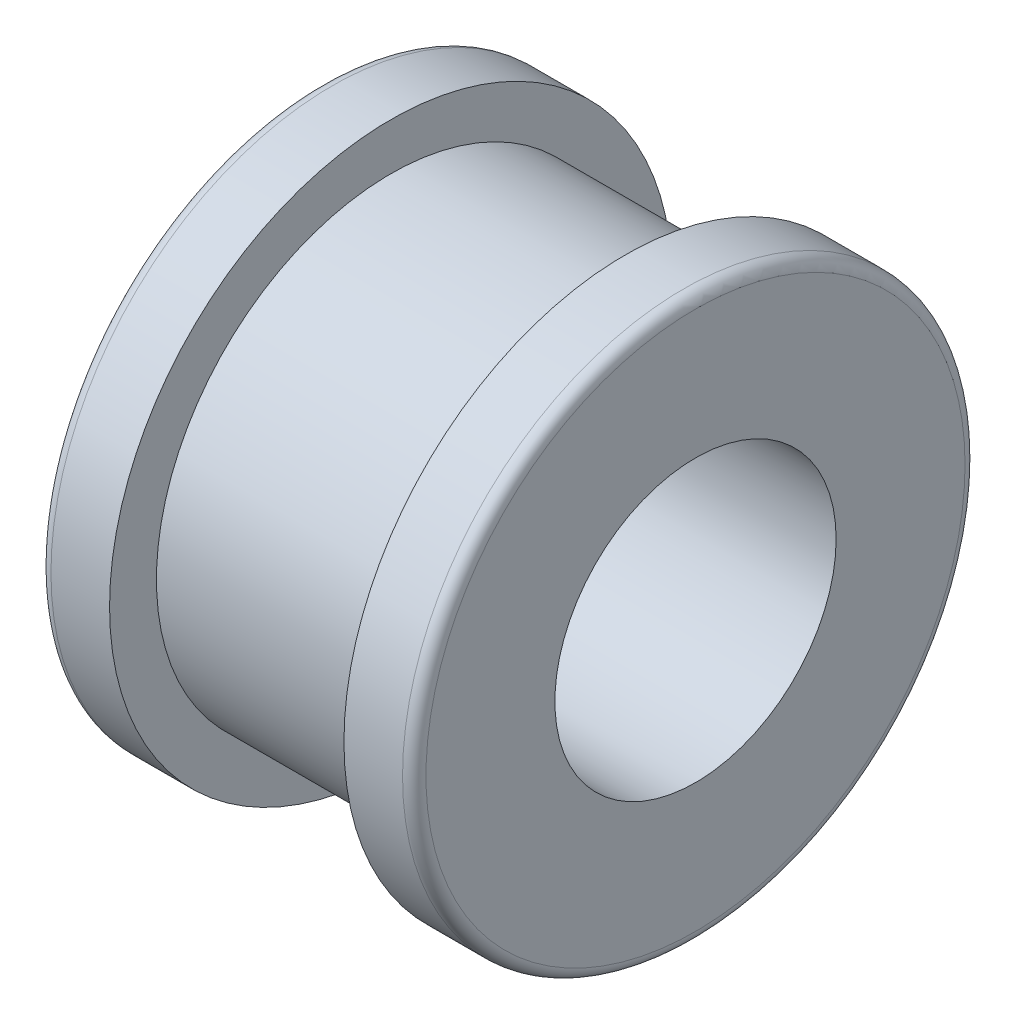
ISO-10303-21;
HEADER;
FILE_DESCRIPTION(('STEP AP214'),'2;1');
FILE_NAME('part.step','',(''),(''),'','','');
FILE_SCHEMA(('AUTOMOTIVE_DESIGN { 1 0 10303 214 1 1 1 1 }'));
ENDSEC;
DATA;
#1=APPLICATION_CONTEXT('core data for automotive mechanical design processes');
#2=APPLICATION_PROTOCOL_DEFINITION('international standard','automotive_design',2000,#1);
#3=PRODUCT_CONTEXT('',#1,'mechanical');
#4=PRODUCT('Part','Part','',(#3));
#5=PRODUCT_RELATED_PRODUCT_CATEGORY('part','',(#4));
#6=PRODUCT_DEFINITION_FORMATION('','',#4);
#7=PRODUCT_DEFINITION_CONTEXT('part definition',#1,'design');
#8=PRODUCT_DEFINITION('design','',#6,#7);
#9=PRODUCT_DEFINITION_SHAPE('','',#8);
#10=(LENGTH_UNIT() NAMED_UNIT(*) SI_UNIT(.MILLI.,.METRE.));
#11=(NAMED_UNIT(*) PLANE_ANGLE_UNIT() SI_UNIT($,.RADIAN.));
#12=(NAMED_UNIT(*) SI_UNIT($,.STERADIAN.) SOLID_ANGLE_UNIT());
#13=UNCERTAINTY_MEASURE_WITH_UNIT(LENGTH_MEASURE(1.E-05),#10,'distance_accuracy_value','');
#14=(GEOMETRIC_REPRESENTATION_CONTEXT(3) GLOBAL_UNCERTAINTY_ASSIGNED_CONTEXT((#13)) GLOBAL_UNIT_ASSIGNED_CONTEXT((#10,
#11,#12)) REPRESENTATION_CONTEXT('',''));
#15=CARTESIAN_POINT('',(0.,0.,0.));
#16=DIRECTION('',(0.,0.,1.));
#17=DIRECTION('',(1.,0.,0.));
#18=AXIS2_PLACEMENT_3D('',#15,#16,#17);
#19=CARTESIAN_POINT('',(8.,0.,0.));
#20=DIRECTION('',(-1.,0.,0.));
#21=DIRECTION('',(0.,0.,1.));
#22=AXIS2_PLACEMENT_3D('',#19,#20,#21);
#23=CYLINDRICAL_SURFACE('',#22,12.);
#24=CARTESIAN_POINT('',(-7.5,0.,0.));
#25=DIRECTION('',(1.,0.,0.));
#26=DIRECTION('',(0.,0.,-1.));
#27=AXIS2_PLACEMENT_3D('',#24,#25,#26);
#28=CIRCLE('',#27,12.);
#29=CARTESIAN_POINT('',(-7.5,0.,-12.));
#30=VERTEX_POINT('',#29);
#31=EDGE_CURVE('E51',#30,#30,#28,.T.);
#32=ORIENTED_EDGE('',*,*,#31,.T.);
#33=EDGE_LOOP('',(#32));
#34=FACE_BOUND('',#33,.T.);
#35=CARTESIAN_POINT('',(-5.,0.,0.));
#36=DIRECTION('',(1.,0.,0.));
#37=DIRECTION('',(0.,0.,-1.));
#38=AXIS2_PLACEMENT_3D('',#35,#36,#37);
#39=CIRCLE('',#38,12.);
#40=CARTESIAN_POINT('',(-5.,0.,-12.));
#41=VERTEX_POINT('',#40);
#42=EDGE_CURVE('E63',#41,#41,#39,.T.);
#43=ORIENTED_EDGE('',*,*,#42,.F.);
#44=EDGE_LOOP('',(#43));
#45=FACE_BOUND('',#44,.T.);
#46=ADVANCED_FACE('F38',(#34,#45),#23,.T.);
#47=CARTESIAN_POINT('',(-8.,0.,0.));
#48=DIRECTION('',(1.,0.,0.));
#49=DIRECTION('',(0.,0.,-1.));
#50=AXIS2_PLACEMENT_3D('',#47,#48,#49);
#51=PLANE('',#50);
#52=CARTESIAN_POINT('',(-8.,0.,0.));
#53=DIRECTION('',(1.,0.,0.));
#54=DIRECTION('',(0.,0.,-1.));
#55=AXIS2_PLACEMENT_3D('',#52,#53,#54);
#56=CIRCLE('',#55,11.5);
#57=CARTESIAN_POINT('',(-8.,0.,-11.5));
#58=VERTEX_POINT('',#57);
#59=EDGE_CURVE('E10',#58,#58,#56,.F.);
#60=ORIENTED_EDGE('',*,*,#59,.T.);
#61=EDGE_LOOP('',(#60));
#62=FACE_BOUND('',#61,.T.);
#63=CARTESIAN_POINT('',(-8.,0.,0.));
#64=DIRECTION('',(1.,0.,0.));
#65=DIRECTION('',(0.,0.,-1.));
#66=AXIS2_PLACEMENT_3D('',#63,#64,#65);
#67=CIRCLE('',#66,6.);
#68=CARTESIAN_POINT('',(-8.,0.,-6.));
#69=VERTEX_POINT('',#68);
#70=EDGE_CURVE('E73',#69,#69,#67,.T.);
#71=ORIENTED_EDGE('',*,*,#70,.T.);
#72=EDGE_LOOP('',(#71));
#73=FACE_BOUND('',#72,.T.);
#74=ADVANCED_FACE('F112',(#62,#73),#51,.F.);
#75=CARTESIAN_POINT('',(-5.,0.,0.));
#76=DIRECTION('',(1.,0.,0.));
#77=DIRECTION('',(0.,0.,-1.));
#78=AXIS2_PLACEMENT_3D('',#75,#76,#77);
#79=PLANE('',#78);
#80=CARTESIAN_POINT('',(-5.,0.,0.));
#81=DIRECTION('',(1.,0.,0.));
#82=DIRECTION('',(0.,0.,-1.));
#83=AXIS2_PLACEMENT_3D('',#80,#81,#82);
#84=CIRCLE('',#83,10.);
#85=CARTESIAN_POINT('',(-5.,0.,-10.));
#86=VERTEX_POINT('',#85);
#87=EDGE_CURVE('E67',#86,#86,#84,.T.);
#88=ORIENTED_EDGE('',*,*,#87,.F.);
#89=EDGE_LOOP('',(#88));
#90=FACE_BOUND('',#89,.T.);
#91=ORIENTED_EDGE('',*,*,#42,.T.);
#92=EDGE_LOOP('',(#91));
#93=FACE_BOUND('',#92,.T.);
#94=ADVANCED_FACE('F117',(#90,#93),#79,.T.);
#95=CARTESIAN_POINT('',(5.,0.,0.));
#96=DIRECTION('',(1.,0.,0.));
#97=DIRECTION('',(0.,0.,-1.));
#98=AXIS2_PLACEMENT_3D('',#95,#96,#97);
#99=PLANE('',#98);
#100=CARTESIAN_POINT('',(5.,0.,0.));
#101=DIRECTION('',(1.,0.,0.));
#102=DIRECTION('',(0.,0.,-1.));
#103=AXIS2_PLACEMENT_3D('',#100,#101,#102);
#104=CIRCLE('',#103,10.);
#105=CARTESIAN_POINT('',(5.,0.,-10.));
#106=VERTEX_POINT('',#105);
#107=EDGE_CURVE('E70',#106,#106,#104,.T.);
#108=ORIENTED_EDGE('',*,*,#107,.T.);
#109=EDGE_LOOP('',(#108));
#110=FACE_BOUND('',#109,.T.);
#111=CARTESIAN_POINT('',(5.,0.,0.));
#112=DIRECTION('',(1.,0.,0.));
#113=DIRECTION('',(0.,0.,-1.));
#114=AXIS2_PLACEMENT_3D('',#111,#112,#113);
#115=CIRCLE('',#114,12.);
#116=CARTESIAN_POINT('',(5.,0.,-12.));
#117=VERTEX_POINT('',#116);
#118=EDGE_CURVE('E64',#117,#117,#115,.T.);
#119=ORIENTED_EDGE('',*,*,#118,.F.);
#120=EDGE_LOOP('',(#119));
#121=FACE_BOUND('',#120,.T.);
#122=ADVANCED_FACE('F124',(#110,#121),#99,.F.);
#123=CARTESIAN_POINT('',(-5.,0.,0.));
#124=DIRECTION('',(1.,0.,0.));
#125=DIRECTION('',(0.,0.,-1.));
#126=AXIS2_PLACEMENT_3D('',#123,#124,#125);
#127=CYLINDRICAL_SURFACE('',#126,10.);
#128=CARTESIAN_POINT('',(1.,-10.,0.));
#129=CARTESIAN_POINT('',(0.99999757409962,-9.99999935520769,0.0560203537915572));
#130=CARTESIAN_POINT('',(0.995276731103556,-9.99952425596206,0.112077745167773));
#131=CARTESIAN_POINT('',(0.976515629709573,-9.99767467594738,0.222638398496837));
#132=CARTESIAN_POINT('',(0.962465103975411,-9.99629920434026,0.277139879168828));
#133=CARTESIAN_POINT('',(0.925457759402168,-9.9928041456307,0.382971675453414));
#134=CARTESIAN_POINT('',(0.902506319481526,-9.99068500800708,0.434303884614909));
#135=CARTESIAN_POINT('',(0.848359092068356,-9.98593957394306,0.532376160960406));
#136=CARTESIAN_POINT('',(0.817164943999862,-9.98331337838132,0.579117138779076));
#137=CARTESIAN_POINT('',(0.747297302337726,-9.97783744341324,0.666859550674082));
#138=CARTESIAN_POINT('',(0.708600200597966,-9.97498701573866,0.707842144834892));
#139=CARTESIAN_POINT('',(0.62487546573697,-9.96938956906263,0.782742521430984));
#140=CARTESIAN_POINT('',(0.579847539957613,-9.96664255484917,0.816659977082653));
#141=CARTESIAN_POINT('',(0.484621468316379,-9.96155591552784,0.876533970443617));
#142=CARTESIAN_POINT('',(0.434412555905142,-9.95921716710905,0.902473465454879));
#143=CARTESIAN_POINT('',(0.330324414095021,-9.95522037546525,0.94554638474276));
#144=CARTESIAN_POINT('',(0.27644527541605,-9.95356231542222,0.962680026591291));
#145=CARTESIAN_POINT('',(0.166738199133991,-9.95112084072978,0.987599041601893));
#146=CARTESIAN_POINT('',(0.110917423147792,-9.95033450398097,0.995415653003795));
#147=CARTESIAN_POINT('',(-0.00124886339578044,-9.94971643060526,1.00157528513536));
#148=CARTESIAN_POINT('',(-0.0575943601220591,-9.94988466888746,0.999918554870802));
#149=CARTESIAN_POINT('',(-0.168995309693318,-9.95115406898935,0.987204280252678));
#150=CARTESIAN_POINT('',(-0.224054699328694,-9.95225184590651,0.976180844124552));
#151=CARTESIAN_POINT('',(-0.331537963201094,-9.95525134287419,0.945099144150586));
#152=CARTESIAN_POINT('',(-0.383961801825031,-9.95715307378492,0.925040758255746));
#153=CARTESIAN_POINT('',(-0.484793587298889,-9.9615500945207,0.876420893881507));
#154=CARTESIAN_POINT('',(-0.533194189489316,-9.96404643908158,0.84784428271998));
#155=CARTESIAN_POINT('',(-0.624525214911882,-9.96935051732879,0.783010027353227));
#156=CARTESIAN_POINT('',(-0.667455477981763,-9.97215826012785,0.746752158336505));
#157=CARTESIAN_POINT('',(-0.746825393989027,-9.9777838531299,0.667394112412069));
#158=CARTESIAN_POINT('',(-0.783235601880805,-9.98060169332997,0.624264478851363));
#159=CARTESIAN_POINT('',(-0.848303632910388,-9.98591829078518,0.532489481737112));
#160=CARTESIAN_POINT('',(-0.876961447356476,-9.98841704768256,0.483844111999601));
#161=CARTESIAN_POINT('',(-0.925710020310253,-9.99281475667096,0.382398105692365));
#162=CARTESIAN_POINT('',(-0.945799284818062,-9.9947136041477,0.329596746389903));
#163=CARTESIAN_POINT('',(-0.976818916711752,-9.99769647441409,0.221347217329932));
#164=CARTESIAN_POINT('',(-0.987749557990623,-9.99878052157063,0.1658991267766));
#165=CARTESIAN_POINT('',(-1.00010430773477,-10.0000085166831,0.0541850990919041));
#166=CARTESIAN_POINT('',(-1.0015690482525,-10.0001564826774,-0.00207630210549165));
#167=CARTESIAN_POINT('',(-0.995057136951236,-9.99950641756797,-0.114043793315699));
#168=CARTESIAN_POINT('',(-0.98708061268472,-9.99870839924468,-0.16974989082047));
#169=CARTESIAN_POINT('',(-0.961946304578424,-9.99625861539194,-0.278908206834674));
#170=CARTESIAN_POINT('',(-0.944807545521989,-9.99460861918039,-0.332364848972019));
#171=CARTESIAN_POINT('',(-0.901854825962729,-9.99063998860609,-0.435644321383781));
#172=CARTESIAN_POINT('',(-0.876040670960603,-9.98832133925254,-0.485467070157117));
#173=CARTESIAN_POINT('',(-0.816369161336087,-9.98326475330422,-0.580248180172142));
#174=CARTESIAN_POINT('',(-0.782485111074183,-9.98052543603441,-0.625189659748917));
#175=CARTESIAN_POINT('',(-0.707673932259073,-9.9749393286952,-0.708761623311878));
#176=CARTESIAN_POINT('',(-0.666746626929683,-9.97209253592971,-0.747391948849177));
#177=CARTESIAN_POINT('',(-0.578833425340999,-9.96660024140755,-0.817386109887145));
#178=CARTESIAN_POINT('',(-0.531826243457378,-9.96395550138975,-0.848723278679543));
#179=CARTESIAN_POINT('',(-0.433192639853315,-9.9591783246089,-0.903058258743828));
#180=CARTESIAN_POINT('',(-0.381566281311604,-9.95704588084038,-0.926056184053882));
#181=CARTESIAN_POINT('',(-0.275251260534206,-9.9535394763405,-0.963015208684475));
#182=CARTESIAN_POINT('',(-0.220568159908879,-9.95216418449789,-0.976992174811861));
#183=CARTESIAN_POINT('',(-0.109616802039228,-9.95032365282877,-0.995564007129462));
#184=CARTESIAN_POINT('',(-0.0533485903043259,-9.94985838690186,-1.00015914239952));
#185=CARTESIAN_POINT('',(0.0589106883567047,-9.94989113107562,-0.999833138471256));
#186=CARTESIAN_POINT('',(0.114901882882815,-9.95038490087009,-0.994953889593112));
#187=CARTESIAN_POINT('',(0.225264917168288,-9.95227103889546,-0.975905452963653));
#188=CARTESIAN_POINT('',(0.27963675510598,-9.95366340813719,-0.96173625476216));
#189=CARTESIAN_POINT('',(0.385217349047857,-9.95718868263187,-0.924521686297503));
#190=CARTESIAN_POINT('',(0.436426541629725,-9.95932148540361,-0.901477544340916));
#191=CARTESIAN_POINT('',(0.534256891671035,-9.96408751839359,-0.847171554911043));
#192=CARTESIAN_POINT('',(0.58087807482063,-9.96672074580951,-0.815909753455415));
#193=CARTESIAN_POINT('',(0.668423674471935,-9.97220487209698,-0.745898556285331));
#194=CARTESIAN_POINT('',(0.709323076367086,-9.97505664726751,-0.707117948890268));
#195=CARTESIAN_POINT('',(0.784052232699658,-9.98064854728783,-0.623231699225109));
#196=CARTESIAN_POINT('',(0.81788029135717,-9.98338864522976,-0.578124544108257));
#197=CARTESIAN_POINT('',(0.877573453854621,-9.98845562069162,-0.482741434161289));
#198=CARTESIAN_POINT('',(0.903418290945183,-9.99078144026812,-0.432452749346764));
#199=CARTESIAN_POINT('',(0.946262422823868,-9.99474629249896,-0.328258279100551));
#200=CARTESIAN_POINT('',(0.963271690953547,-9.99638609909654,-0.274356649825609));
#201=CARTESIAN_POINT('',(0.983720617084802,-9.99838213773734,-0.183458261405704));
#202=CARTESIAN_POINT('',(0.989817044299357,-9.99898600691833,-0.147042552844509));
#203=CARTESIAN_POINT('',(0.997957526061762,-9.99979514950786,-0.073756580817313));
#204=CARTESIAN_POINT('',(1.00000159732186,-10.0000004245602,-0.0368863192265578));
#205=CARTESIAN_POINT('',(1.,-10.,0.));
#206=B_SPLINE_CURVE_WITH_KNOTS('',3,(#128,#129,#130,#131,#132,#133,#134,#135,#136,#137,#138,
#139,#140,#141,#142,#143,#144,#145,#146,#147,#148,#149,#150,#151,#152,#153,#154,#155,#156,#157,
#158,#159,#160,#161,#162,#163,#164,#165,#166,#167,#168,#169,#170,#171,#172,#173,#174,#175,#176,
#177,#178,#179,#180,#181,#182,#183,#184,#185,#186,#187,#188,#189,#190,#191,#192,#193,#194,#195,
#196,#197,#198,#199,#200,#201,#202,#203,#204,#205),.UNSPECIFIED.,.T.,.F.,(4,2,2,2,2,2,2,2,2,2,2,
2,2,2,2,2,2,2,2,2,2,2,2,2,2,2,2,2,2,2,2,2,2,2,2,2,2,2,4),(0.,0.167926366268474,
0.336037842835486,0.504047885732202,0.672024537582782,0.840538568622945,1.00906039220706,
1.17793975472222,1.34681494442504,1.51512232045197,1.68342527255776,1.8511179744111,
2.01881294161634,2.18680761372895,2.35480720331125,2.52354734196207,2.69228766979772,
2.86105740693581,3.02982209675439,3.19786188607758,3.36589940519143,3.53358935294305,
3.70128306049467,3.86953940748698,4.0377999781023,4.20666643608598,4.37553058475374,
4.54409690593003,4.71265839239585,4.88047629293956,5.04829438226039,5.216089253628,
5.3838831853896,5.55238917427653,5.72093552636958,5.88990631026242,6.05868594795295,
6.16925667232348,6.27982694069027),.UNSPECIFIED.);
#207=CARTESIAN_POINT('',(1.,-10.,0.));
#208=VERTEX_POINT('',#207);
#209=EDGE_CURVE('E81',#208,#208,#206,.T.);
#210=ORIENTED_EDGE('',*,*,#209,.F.);
#211=EDGE_LOOP('',(#210));
#212=FACE_BOUND('',#211,.T.);
#213=ORIENTED_EDGE('',*,*,#87,.T.);
#214=EDGE_LOOP('',(#213));
#215=FACE_BOUND('',#214,.T.);
#216=ORIENTED_EDGE('',*,*,#107,.F.);
#217=EDGE_LOOP('',(#216));
#218=FACE_BOUND('',#217,.T.);
#219=ADVANCED_FACE('F87',(#212,#215,#218),#127,.T.);
#220=CARTESIAN_POINT('',(8.,0.,0.));
#221=DIRECTION('',(1.,0.,0.));
#222=DIRECTION('',(0.,0.,-1.));
#223=AXIS2_PLACEMENT_3D('',#220,#221,#222);
#224=PLANE('',#223);
#225=CARTESIAN_POINT('',(8.,0.,0.));
#226=DIRECTION('',(1.,0.,0.));
#227=DIRECTION('',(0.,0.,-1.));
#228=AXIS2_PLACEMENT_3D('',#225,#226,#227);
#229=CIRCLE('',#228,11.5);
#230=CARTESIAN_POINT('',(8.,0.,-11.5));
#231=VERTEX_POINT('',#230);
#232=EDGE_CURVE('E60',#231,#231,#229,.T.);
#233=ORIENTED_EDGE('',*,*,#232,.T.);
#234=EDGE_LOOP('',(#233));
#235=FACE_BOUND('',#234,.T.);
#236=CARTESIAN_POINT('',(8.,0.,0.));
#237=DIRECTION('',(1.,0.,0.));
#238=DIRECTION('',(0.,0.,-1.));
#239=AXIS2_PLACEMENT_3D('',#236,#237,#238);
#240=CIRCLE('',#239,6.);
#241=CARTESIAN_POINT('',(8.,0.,-6.));
#242=VERTEX_POINT('',#241);
#243=EDGE_CURVE('E78',#242,#242,#240,.T.);
#244=ORIENTED_EDGE('',*,*,#243,.F.);
#245=EDGE_LOOP('',(#244));
#246=FACE_BOUND('',#245,.T.);
#247=ADVANCED_FACE('F106',(#235,#246),#224,.T.);
#248=CARTESIAN_POINT('',(7.5,0.,0.));
#249=DIRECTION('',(1.,0.,0.));
#250=DIRECTION('',(0.,0.,-1.));
#251=AXIS2_PLACEMENT_3D('',#248,#249,#250);
#252=CIRCLE('',#251,12.);
#253=CARTESIAN_POINT('',(7.5,0.,-12.));
#254=VERTEX_POINT('',#253);
#255=EDGE_CURVE('E55',#254,#254,#252,.F.);
#256=ORIENTED_EDGE('',*,*,#255,.T.);
#257=EDGE_LOOP('',(#256));
#258=FACE_BOUND('',#257,.T.);
#259=ORIENTED_EDGE('',*,*,#118,.T.);
#260=EDGE_LOOP('',(#259));
#261=FACE_BOUND('',#260,.T.);
#262=ADVANCED_FACE('F99',(#258,#261),#23,.T.);
#263=CARTESIAN_POINT('',(-8.,0.,0.));
#264=DIRECTION('',(1.,0.,0.));
#265=DIRECTION('',(0.,0.,-1.));
#266=AXIS2_PLACEMENT_3D('',#263,#264,#265);
#267=CYLINDRICAL_SURFACE('',#266,6.);
#268=CARTESIAN_POINT('',(0.,-5.91607978309962,1.));
#269=CARTESIAN_POINT('',(-0.0557502992584118,-5.91608078960511,0.999997759368402));
#270=CARTESIAN_POINT('',(-0.111531042409948,-5.91687637019227,0.995322067614928));
#271=CARTESIAN_POINT('',(-0.221527417288066,-5.91996982947271,0.976750971230157));
#272=CARTESIAN_POINT('',(-0.27574155749981,-5.92226909356571,0.962847064123861));
#273=CARTESIAN_POINT('',(-0.380996913342711,-5.9281024372893,0.926251817466857));
#274=CARTESIAN_POINT('',(-0.432040739466525,-5.9316354846878,0.903567821972435));
#275=CARTESIAN_POINT('',(-0.529592381885484,-5.93953708845736,0.850074598756146));
#276=CARTESIAN_POINT('',(-0.576100707830495,-5.94390555078989,0.819266285400627));
#277=CARTESIAN_POINT('',(-0.663725139898267,-5.95303388461044,0.75007501078652));
#278=CARTESIAN_POINT('',(-0.704790052554605,-5.95779686930827,0.711627619572909));
#279=CARTESIAN_POINT('',(-0.779917322744606,-5.96714992267783,0.628388801878136));
#280=CARTESIAN_POINT('',(-0.813979265246135,-5.97173998108788,0.583596999659995));
#281=CARTESIAN_POINT('',(-0.874325826887742,-5.98026294792988,0.488609147979335));
#282=CARTESIAN_POINT('',(-0.90056280309273,-5.98419176972911,0.438382432582681));
#283=CARTESIAN_POINT('',(-0.944208428212213,-5.99091494782862,0.334158248689549));
#284=CARTESIAN_POINT('',(-0.961617651153948,-5.9937093778907,0.280161025631276));
#285=CARTESIAN_POINT('',(-0.986957013993562,-5.99782693889752,0.170457490537697));
#286=CARTESIAN_POINT('',(-0.994973166401878,-5.99916341244362,0.114771554671708));
#287=CARTESIAN_POINT('',(-1.00156630166104,-6.00026031737113,0.00283011421031905));
#288=CARTESIAN_POINT('',(-1.00014392609889,-6.00002085587723,-0.0534253514115594));
#289=CARTESIAN_POINT('',(-0.987967459388716,-5.99800343372556,-0.16432087403155));
#290=CARTESIAN_POINT('',(-0.977305934636339,-5.99624073476959,-0.218971412280056));
#291=CARTESIAN_POINT('',(-0.947099570301403,-5.99139191508655,-0.325696791844717));
#292=CARTESIAN_POINT('',(-0.9275544601642,-5.98830575405284,-0.377771554660602));
#293=CARTESIAN_POINT('',(-0.880043743873873,-5.98113079404783,-0.478142459113059));
#294=CARTESIAN_POINT('',(-0.852039995167024,-5.97703746930752,-0.526420209207618));
#295=CARTESIAN_POINT('',(-0.78843487094598,-5.96830295228599,-0.617626211938657));
#296=CARTESIAN_POINT('',(-0.752832880515673,-5.96366171567654,-0.66055403116635));
#297=CARTESIAN_POINT('',(-0.674528477352277,-5.95428107293039,-0.740388509378666));
#298=CARTESIAN_POINT('',(-0.631745162039607,-5.94954115892417,-0.777215800901283));
#299=CARTESIAN_POINT('',(-0.540565163913672,-5.94055183913922,-0.843181835379226));
#300=CARTESIAN_POINT('',(-0.492168429326872,-5.9363024378853,-0.872320507412967));
#301=CARTESIAN_POINT('',(-0.391043343249008,-5.92877501824727,-0.922097773795314));
#302=CARTESIAN_POINT('',(-0.338310200763164,-5.92549809321041,-0.942726810911697));
#303=CARTESIAN_POINT('',(-0.230060371076983,-5.92030475475952,-0.974811948326247));
#304=CARTESIAN_POINT('',(-0.174543929427031,-5.91838822155329,-0.986268856307182));
#305=CARTESIAN_POINT('',(-0.0630135375351475,-5.91615583768847,-0.999572753951706));
#306=CARTESIAN_POINT('',(-0.00701344811915934,-5.91582114303468,-1.00153288316498));
#307=CARTESIAN_POINT('',(0.104514668676328,-5.91674013912945,-0.996089081072983));
#308=CARTESIAN_POINT('',(0.160042714205589,-5.91799376852741,-0.988685511449866));
#309=CARTESIAN_POINT('',(0.268691103676343,-5.92193074982007,-0.964820933971239));
#310=CARTESIAN_POINT('',(0.321824455951204,-5.92460500767339,-0.948417516258554));
#311=CARTESIAN_POINT('',(0.424588066511794,-5.93107429202201,-0.907079276076911));
#312=CARTESIAN_POINT('',(0.474218115020361,-5.93486938556232,-0.882143943240374));
#313=CARTESIAN_POINT('',(0.569069837762444,-5.94319651358957,-0.824182669291691));
#314=CARTESIAN_POINT('',(0.614246629102423,-5.94773502240139,-0.791084225663745));
#315=CARTESIAN_POINT('',(0.698445413078001,-5.95701866671947,-0.717835786283193));
#316=CARTESIAN_POINT('',(0.737466972443896,-5.96176381674133,-0.677685294553618));
#317=CARTESIAN_POINT('',(0.808660757091481,-5.97098568847306,-0.590971228131524));
#318=CARTESIAN_POINT('',(0.840757530513817,-5.97545910537869,-0.544345301354478));
#319=CARTESIAN_POINT('',(0.896662130801952,-5.98358044973177,-0.44629737917973));
#320=CARTESIAN_POINT('',(0.92047022578954,-5.9872284038799,-0.394875538988251));
#321=CARTESIAN_POINT('',(0.959004233581946,-5.99327343267833,-0.288919620600531));
#322=CARTESIAN_POINT('',(0.973769630293967,-5.99567593827049,-0.234400225041044));
#323=CARTESIAN_POINT('',(0.993926239585532,-5.99898233267713,-0.123612293949685));
#324=CARTESIAN_POINT('',(0.999318223492944,-5.99988634480071,-0.0673439027286497));
#325=CARTESIAN_POINT('',(1.00055275292488,-6.0000921515513,0.044616510309472));
#326=CARTESIAN_POINT('',(0.996510101576422,-5.99941320809696,0.100307264241071));
#327=CARTESIAN_POINT('',(0.97923843109224,-5.99656871354913,0.210204789725876));
#328=CARTESIAN_POINT('',(0.966009463396175,-5.99440317078001,0.26441156958697));
#329=CARTESIAN_POINT('',(0.930784733782497,-5.98882795531034,0.369758578367437));
#330=CARTESIAN_POINT('',(0.908798732715821,-5.98541966816622,0.420902148861609));
#331=CARTESIAN_POINT('',(0.856696825507926,-5.97773102750941,0.518792181192786));
#332=CARTESIAN_POINT('',(0.826580533975613,-5.97345063265953,0.565538434446986));
#333=CARTESIAN_POINT('',(0.758665963015201,-5.96443051847589,0.653885178210864));
#334=CARTESIAN_POINT('',(0.72078361809725,-5.95968609820294,0.695420572242245));
#335=CARTESIAN_POINT('',(0.638588676840723,-5.95030521321901,0.771585550379217));
#336=CARTESIAN_POINT('',(0.594274576443382,-5.94566877405441,0.806213514680476));
#337=CARTESIAN_POINT('',(0.500101870996945,-5.93699337428039,0.867805708367845));
#338=CARTESIAN_POINT('',(0.450206264064781,-5.93295887192494,0.894713995637815));
#339=CARTESIAN_POINT('',(0.346556305635426,-5.92599684088708,0.939725814576364));
#340=CARTESIAN_POINT('',(0.292805870921243,-5.92306820700509,0.95783814209264));
#341=CARTESIAN_POINT('',(0.199038492209334,-5.91929897935112,0.980810421248857));
#342=CARTESIAN_POINT('',(0.159589276816625,-5.91809849368407,0.987994967068111));
#343=CARTESIAN_POINT('',(0.0800986060635565,-5.91648854114608,0.997590518072968));
#344=CARTESIAN_POINT('',(0.0400571614679344,-5.91607905991511,1.00000160991677));
#345=CARTESIAN_POINT('',(0.,-5.91607978309962,1.));
#346=B_SPLINE_CURVE_WITH_KNOTS('',3,(#268,#269,#270,#271,#272,#273,#274,#275,#276,#277,#278,
#279,#280,#281,#282,#283,#284,#285,#286,#287,#288,#289,#290,#291,#292,#293,#294,#295,#296,#297,
#298,#299,#300,#301,#302,#303,#304,#305,#306,#307,#308,#309,#310,#311,#312,#313,#314,#315,#316,
#317,#318,#319,#320,#321,#322,#323,#324,#325,#326,#327,#328,#329,#330,#331,#332,#333,#334,#335,
#336,#337,#338,#339,#340,#341,#342,#343,#344,#345),.UNSPECIFIED.,.T.,.F.,(4,2,2,2,2,2,2,2,2,2,2,
2,2,2,2,2,2,2,2,2,2,2,2,2,2,2,2,2,2,2,2,2,2,2,2,2,2,2,4),(0.,0.167104415562128,
0.334363007967779,0.501481999132666,0.668582189603687,0.83715663660545,1.00574107132038,
1.17533192042833,1.34491174042704,1.51292626987285,1.68092937859336,1.84726848464127,
2.01361265698072,2.18071841654029,2.34783770488965,2.51698449383108,2.68613284296667,
2.85547064997701,3.0247935437349,3.19209416966423,3.3593883336385,3.52562425852456,
3.69187012915689,3.8596493710334,4.02744041770535,4.19697645212412,4.36650700188938,
4.53529193765317,4.70406298363199,4.87079110504626,5.03751829285788,5.20406015931242,
5.37060992155193,5.5390679898356,5.70756551550984,5.8772549104514,6.04677426695051,
6.16684268214775,6.28690891757997),.UNSPECIFIED.);
#347=CARTESIAN_POINT('',(0.,-5.91607978309962,1.));
#348=VERTEX_POINT('',#347);
#349=EDGE_CURVE('E42',#348,#348,#346,.T.);
#350=ORIENTED_EDGE('',*,*,#349,.T.);
#351=EDGE_LOOP('',(#350));
#352=FACE_BOUND('',#351,.T.);
#353=ORIENTED_EDGE('',*,*,#70,.F.);
#354=EDGE_LOOP('',(#353));
#355=FACE_BOUND('',#354,.T.);
#356=ORIENTED_EDGE('',*,*,#243,.T.);
#357=EDGE_LOOP('',(#356));
#358=FACE_BOUND('',#357,.T.);
#359=ADVANCED_FACE('F94',(#352,#355,#358),#267,.F.);
#360=CARTESIAN_POINT('',(7.5,0.,0.));
#361=DIRECTION('',(1.,0.,0.));
#362=DIRECTION('',(0.,0.,-1.));
#363=AXIS2_PLACEMENT_3D('',#360,#361,#362);
#364=TOROIDAL_SURFACE('',#363,11.5,0.5);
#365=ORIENTED_EDGE('',*,*,#255,.F.);
#366=EDGE_LOOP('',(#365));
#367=FACE_BOUND('',#366,.T.);
#368=ORIENTED_EDGE('',*,*,#232,.F.);
#369=EDGE_LOOP('',(#368));
#370=FACE_BOUND('',#369,.T.);
#371=ADVANCED_FACE('F98',(#367,#370),#364,.T.);
#372=CARTESIAN_POINT('',(-7.5,0.,0.));
#373=DIRECTION('',(1.,0.,0.));
#374=DIRECTION('',(0.,0.,-1.));
#375=AXIS2_PLACEMENT_3D('',#372,#373,#374);
#376=TOROIDAL_SURFACE('',#375,11.5,0.5);
#377=ORIENTED_EDGE('',*,*,#59,.F.);
#378=EDGE_LOOP('',(#377));
#379=FACE_BOUND('',#378,.T.);
#380=ORIENTED_EDGE('',*,*,#31,.F.);
#381=EDGE_LOOP('',(#380));
#382=FACE_BOUND('',#381,.T.);
#383=ADVANCED_FACE('F40',(#379,#382),#376,.T.);
#384=CARTESIAN_POINT('',(0.,-10.,0.));
#385=DIRECTION('',(0.,1.,0.));
#386=DIRECTION('',(0.,0.,1.));
#387=AXIS2_PLACEMENT_3D('',#384,#385,#386);
#388=CYLINDRICAL_SURFACE('',#387,1.);
#389=ORIENTED_EDGE('',*,*,#209,.T.);
#390=EDGE_LOOP('',(#389));
#391=FACE_BOUND('',#390,.T.);
#392=ORIENTED_EDGE('',*,*,#349,.F.);
#393=EDGE_LOOP('',(#392));
#394=FACE_BOUND('',#393,.T.);
#395=ADVANCED_FACE('F90',(#391,#394),#388,.F.);
#396=CLOSED_SHELL('',(#46,#74,#94,#122,#219,#247,#262,#359,#371,#383,#395));
#397=MANIFOLD_SOLID_BREP('B2',#396);
#398=ADVANCED_BREP_SHAPE_REPRESENTATION('',(#18,#397),#14);
#399=SHAPE_DEFINITION_REPRESENTATION(#9,#398);
ENDSEC;
END-ISO-10303-21;
